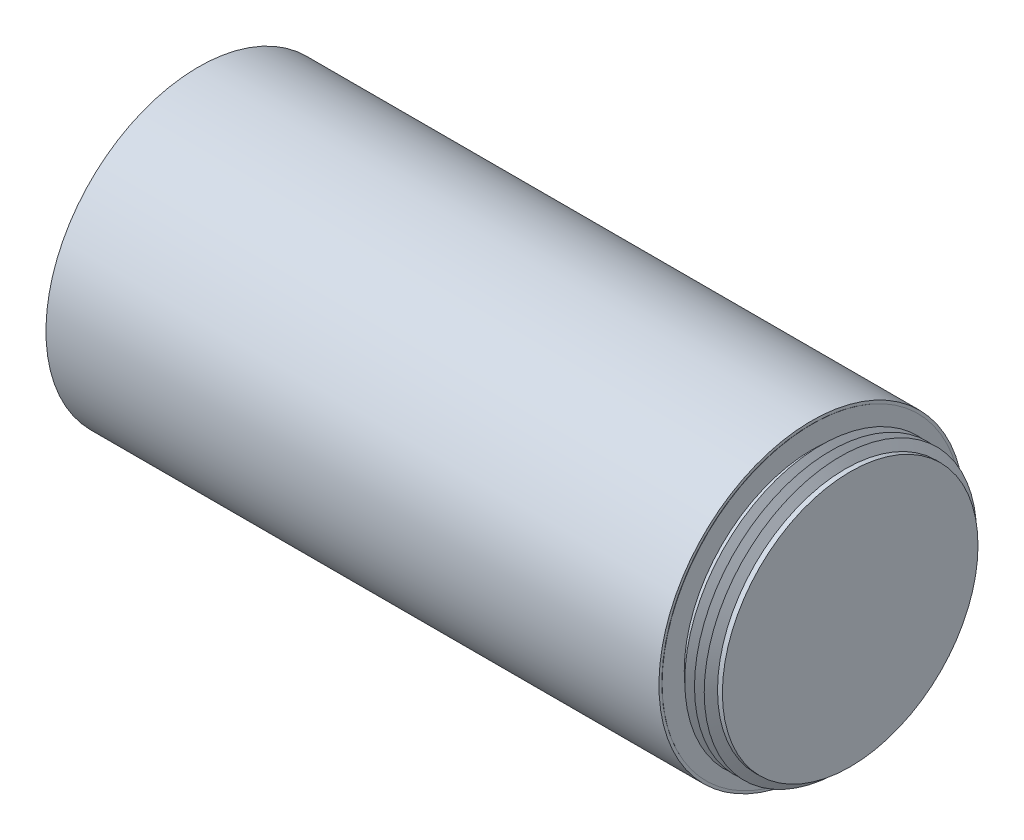
ISO-10303-21;
HEADER;
FILE_DESCRIPTION(('STEP AP214'),'2;1');
FILE_NAME('part.step','',(''),(''),'','','');
FILE_SCHEMA(('AUTOMOTIVE_DESIGN { 1 0 10303 214 1 1 1 1 }'));
ENDSEC;
DATA;
#1=APPLICATION_CONTEXT('core data for automotive mechanical design processes');
#2=APPLICATION_PROTOCOL_DEFINITION('international standard','automotive_design',2000,#1);
#3=PRODUCT_CONTEXT('',#1,'mechanical');
#4=PRODUCT('Part','Part','',(#3));
#5=PRODUCT_RELATED_PRODUCT_CATEGORY('part','',(#4));
#6=PRODUCT_DEFINITION_FORMATION('','',#4);
#7=PRODUCT_DEFINITION_CONTEXT('part definition',#1,'design');
#8=PRODUCT_DEFINITION('design','',#6,#7);
#9=PRODUCT_DEFINITION_SHAPE('','',#8);
#10=(LENGTH_UNIT() NAMED_UNIT(*) SI_UNIT(.MILLI.,.METRE.));
#11=(NAMED_UNIT(*) PLANE_ANGLE_UNIT() SI_UNIT($,.RADIAN.));
#12=(NAMED_UNIT(*) SI_UNIT($,.STERADIAN.) SOLID_ANGLE_UNIT());
#13=UNCERTAINTY_MEASURE_WITH_UNIT(LENGTH_MEASURE(1.E-05),#10,'distance_accuracy_value','');
#14=(GEOMETRIC_REPRESENTATION_CONTEXT(3) GLOBAL_UNCERTAINTY_ASSIGNED_CONTEXT((#13)) GLOBAL_UNIT_ASSIGNED_CONTEXT((#10,
#11,#12)) REPRESENTATION_CONTEXT('',''));
#15=CARTESIAN_POINT('',(0.,0.,0.));
#16=DIRECTION('',(0.,0.,1.));
#17=DIRECTION('',(1.,0.,0.));
#18=AXIS2_PLACEMENT_3D('',#15,#16,#17);
#19=CARTESIAN_POINT('',(-101.282037882412,-112.40761589404,6.95959679333066E-13));
#20=DIRECTION('',(1.,0.,0.));
#21=DIRECTION('',(0.,0.203317589338989,0.979112842253324));
#22=AXIS2_PLACEMENT_3D('',#19,#20,#21);
#23=PLANE('',#22);
#24=CARTESIAN_POINT('',(-101.282037882412,-112.40761589404,6.95959679333066E-13));
#25=DIRECTION('',(1.,0.,0.));
#26=DIRECTION('',(0.,0.203317589338989,0.979112842253324));
#27=AXIS2_PLACEMENT_3D('',#24,#25,#26);
#28=CIRCLE('',#27,49.784);
#29=CARTESIAN_POINT('',(-101.282037882411,-102.285653026388,48.7441537387402));
#30=VERTEX_POINT('',#29);
#31=EDGE_CURVE('E67',#30,#30,#28,.T.);
#32=ORIENTED_EDGE('',*,*,#31,.T.);
#33=EDGE_LOOP('',(#32));
#34=FACE_BOUND('',#33,.T.);
#35=CARTESIAN_POINT('',(-101.282037882412,-112.40761589404,8.14057642514373E-13));
#36=DIRECTION('',(1.,0.,0.));
#37=DIRECTION('',(0.,0.,-1.));
#38=AXIS2_PLACEMENT_3D('',#35,#36,#37);
#39=CIRCLE('',#38,48.8237923991093);
#40=CARTESIAN_POINT('',(-101.282037882412,-112.40761589404,-48.8237923991085));
#41=VERTEX_POINT('',#40);
#42=EDGE_CURVE('E18',#41,#41,#39,.T.);
#43=ORIENTED_EDGE('',*,*,#42,.F.);
#44=EDGE_LOOP('',(#43));
#45=FACE_BOUND('',#44,.T.);
#46=ADVANCED_FACE('F14',(#34,#45),#23,.T.);
#47=CARTESIAN_POINT('',(-301.281637882411,-112.40761589404,9.0639775579916E-13));
#48=DIRECTION('',(1.,0.,0.));
#49=DIRECTION('',(0.,0.203317589338989,0.979112842253324));
#50=AXIS2_PLACEMENT_3D('',#47,#48,#49);
#51=PLANE('',#50);
#52=CARTESIAN_POINT('',(-301.281637882411,-112.40761589404,9.0639775579916E-13));
#53=DIRECTION('',(1.,0.,0.));
#54=DIRECTION('',(0.,0.203317589338989,0.979112842253324));
#55=AXIS2_PLACEMENT_3D('',#52,#53,#54);
#56=CIRCLE('',#55,49.784);
#57=CARTESIAN_POINT('',(-301.281637882411,-102.285653026388,48.7441537387404));
#58=VERTEX_POINT('',#57);
#59=EDGE_CURVE('E68',#58,#58,#56,.T.);
#60=ORIENTED_EDGE('',*,*,#59,.F.);
#61=EDGE_LOOP('',(#60));
#62=FACE_BOUND('',#61,.T.);
#63=CARTESIAN_POINT('',(-301.281637882411,-112.40761589404,8.95453312079027E-13));
#64=DIRECTION('',(1.,0.,0.));
#65=DIRECTION('',(0.,0.,-1.));
#66=AXIS2_PLACEMENT_3D('',#63,#64,#65);
#67=CIRCLE('',#66,48.9203999999995);
#68=CARTESIAN_POINT('',(-301.281637882412,-112.40761589404,-48.9203999999986));
#69=VERTEX_POINT('',#68);
#70=EDGE_CURVE('E64',#69,#69,#67,.F.);
#71=ORIENTED_EDGE('',*,*,#70,.F.);
#72=EDGE_LOOP('',(#71));
#73=FACE_BOUND('',#72,.T.);
#74=ADVANCED_FACE('F276',(#62,#73),#51,.F.);
#75=CARTESIAN_POINT('',(-101.282037882412,-112.40761589404,6.95959679333066E-13));
#76=DIRECTION('',(-1.,0.,0.));
#77=DIRECTION('',(0.,-0.203317589338989,-0.979112842253324));
#78=AXIS2_PLACEMENT_3D('',#75,#76,#77);
#79=CYLINDRICAL_SURFACE('',#78,49.784);
#80=ORIENTED_EDGE('',*,*,#31,.F.);
#81=EDGE_LOOP('',(#80));
#82=FACE_BOUND('',#81,.T.);
#83=ORIENTED_EDGE('',*,*,#59,.T.);
#84=EDGE_LOOP('',(#83));
#85=FACE_BOUND('',#84,.T.);
#86=ADVANCED_FACE('F283',(#82,#85),#79,.T.);
#87=CARTESIAN_POINT('',(-301.281637882412,-112.40761589404,8.88550369128855E-13));
#88=DIRECTION('',(1.,0.,0.));
#89=DIRECTION('',(0.,0.999990910254518,-0.00426373173999859));
#90=AXIS2_PLACEMENT_3D('',#87,#88,#89);
#91=CIRCLE('',#90,44.45);
#92=CARTESIAN_POINT('',(-301.281637882412,-67.9580199332265,-0.189522875842049));
#93=VERTEX_POINT('',#92);
#94=EDGE_CURVE('E155',#93,#93,#91,.T.);
#95=ORIENTED_EDGE('',*,*,#94,.T.);
#96=EDGE_LOOP('',(#95));
#97=FACE_BOUND('',#96,.T.);
#98=ORIENTED_EDGE('',*,*,#70,.T.);
#99=EDGE_LOOP('',(#98));
#100=FACE_BOUND('',#99,.T.);
#101=ADVANCED_FACE('F163',(#97,#100),#51,.F.);
#102=CARTESIAN_POINT('',(-101.114708609272,-112.40761589404,7.84938641112028E-13));
#103=DIRECTION('',(1.,0.,0.));
#104=DIRECTION('',(0.,0.,-1.));
#105=AXIS2_PLACEMENT_3D('',#102,#103,#104);
#106=CONICAL_SURFACE('',#105,48.9204,0.523598775598301);
#107=ORIENTED_EDGE('',*,*,#42,.T.);
#108=EDGE_LOOP('',(#107));
#109=FACE_BOUND('',#108,.T.);
#110=CARTESIAN_POINT('',(-101.114708609272,-112.40761589404,7.84938641112028E-13));
#111=DIRECTION('',(-1.,0.,0.));
#112=DIRECTION('',(0.,0.,1.));
#113=AXIS2_PLACEMENT_3D('',#110,#111,#112);
#114=CIRCLE('',#113,48.9204);
#115=CARTESIAN_POINT('',(-101.114708609272,-112.40761589404,48.9204000000008));
#116=VERTEX_POINT('',#115);
#117=EDGE_CURVE('E9',#116,#116,#114,.T.);
#118=ORIENTED_EDGE('',*,*,#117,.T.);
#119=EDGE_LOOP('',(#118));
#120=FACE_BOUND('',#119,.T.);
#121=ADVANCED_FACE('F16',(#109,#120),#106,.T.);
#122=CARTESIAN_POINT('',(-101.114708609272,-63.4872158940397,7.84938641112028E-13));
#123=DIRECTION('',(-1.,0.,0.));
#124=DIRECTION('',(0.,0.,1.));
#125=AXIS2_PLACEMENT_3D('',#122,#123,#124);
#126=PLANE('',#125);
#127=ORIENTED_EDGE('',*,*,#117,.F.);
#128=EDGE_LOOP('',(#127));
#129=FACE_BOUND('',#128,.T.);
#130=CARTESIAN_POINT('',(-101.114708609271,-112.40761589404,7.84938641112028E-13));
#131=DIRECTION('',(1.,0.,0.));
#132=DIRECTION('',(0.,0.,-1.));
#133=AXIS2_PLACEMENT_3D('',#130,#131,#132);
#134=CIRCLE('',#133,41.70035475);
#135=CARTESIAN_POINT('',(-101.114708609271,-112.40761589404,-41.7003547499992));
#136=VERTEX_POINT('',#135);
#137=EDGE_CURVE('E23',#136,#136,#134,.T.);
#138=ORIENTED_EDGE('',*,*,#137,.F.);
#139=EDGE_LOOP('',(#138));
#140=FACE_BOUND('',#139,.T.);
#141=ADVANCED_FACE('F329',(#129,#140),#126,.F.);
#142=CARTESIAN_POINT('',(-88.6687086092715,-67.9576158940398,7.84938641112028E-13));
#143=DIRECTION('',(-1.,0.,0.));
#144=DIRECTION('',(0.,0.,1.));
#145=AXIS2_PLACEMENT_3D('',#142,#143,#144);
#146=PLANE('',#145);
#147=CARTESIAN_POINT('',(-88.6687086092715,-112.40761589404,7.84938641112028E-13));
#148=DIRECTION('',(1.,0.,0.));
#149=DIRECTION('',(0.,0.,-1.));
#150=AXIS2_PLACEMENT_3D('',#147,#148,#149);
#151=CIRCLE('',#150,41.70035475);
#152=CARTESIAN_POINT('',(-88.6687086092715,-112.40761589404,-41.7003547499992));
#153=VERTEX_POINT('',#152);
#154=EDGE_CURVE('E60',#153,#153,#151,.T.);
#155=ORIENTED_EDGE('',*,*,#154,.T.);
#156=EDGE_LOOP('',(#155));
#157=FACE_BOUND('',#156,.T.);
#158=ADVANCED_FACE('F326',(#157),#146,.F.);
#159=CARTESIAN_POINT('',(-88.6687086092715,-112.40761589404,7.84938641112028E-13));
#160=DIRECTION('',(1.,0.,0.));
#161=DIRECTION('',(0.,0.,-1.));
#162=AXIS2_PLACEMENT_3D('',#159,#160,#161);
#163=CYLINDRICAL_SURFACE('',#162,41.70035475);
#164=CARTESIAN_POINT('',(-99.7812591608523,-112.40761589404,7.84938641112028E-13));
#165=DIRECTION('',(1.,0.,0.));
#166=DIRECTION('',(0.,0.,-1.));
#167=AXIS2_PLACEMENT_3D('',#164,#165,#166);
#168=CIRCLE('',#167,41.70035475);
#169=CARTESIAN_POINT('',(-99.7812591608523,-112.40761589404,-41.7003547499992));
#170=VERTEX_POINT('',#169);
#171=EDGE_CURVE('E30',#170,#170,#168,.T.);
#172=ORIENTED_EDGE('',*,*,#171,.F.);
#173=EDGE_LOOP('',(#172));
#174=FACE_BOUND('',#173,.T.);
#175=ORIENTED_EDGE('',*,*,#137,.T.);
#176=EDGE_LOOP('',(#175));
#177=FACE_BOUND('',#176,.T.);
#178=ADVANCED_FACE('F322',(#174,#177),#163,.T.);
#179=CARTESIAN_POINT('',(-99.7812591608523,-112.40761589404,7.84938641112028E-13));
#180=DIRECTION('',(1.,0.,0.));
#181=DIRECTION('',(0.,0.,-1.));
#182=AXIS2_PLACEMENT_3D('',#179,#180,#181);
#183=CONICAL_SURFACE('',#182,41.70035475,1.0471975511966);
#184=CARTESIAN_POINT('',(-98.1937507355888,-112.40761589404,7.84938641112028E-13));
#185=DIRECTION('',(1.,0.,0.));
#186=DIRECTION('',(0.,0.,-1.));
#187=AXIS2_PLACEMENT_3D('',#184,#185,#186);
#188=CIRCLE('',#187,44.45);
#189=CARTESIAN_POINT('',(-98.1937507355888,-112.40761589404,-44.4499999999992));
#190=VERTEX_POINT('',#189);
#191=EDGE_CURVE('E36',#190,#190,#188,.T.);
#192=ORIENTED_EDGE('',*,*,#191,.F.);
#193=EDGE_LOOP('',(#192));
#194=FACE_BOUND('',#193,.T.);
#195=ORIENTED_EDGE('',*,*,#171,.T.);
#196=EDGE_LOOP('',(#195));
#197=FACE_BOUND('',#196,.T.);
#198=ADVANCED_FACE('F318',(#194,#197),#183,.T.);
#199=CARTESIAN_POINT('',(-98.1937507355888,-112.40761589404,7.84938641112028E-13));
#200=DIRECTION('',(-1.,0.,0.));
#201=DIRECTION('',(0.,0.,1.));
#202=AXIS2_PLACEMENT_3D('',#199,#200,#201);
#203=CONICAL_SURFACE('',#202,44.45,1.0471975511966);
#204=CARTESIAN_POINT('',(-96.6062423103254,-112.40761589404,7.84938641112028E-13));
#205=DIRECTION('',(1.,0.,0.));
#206=DIRECTION('',(0.,0.,-1.));
#207=AXIS2_PLACEMENT_3D('',#204,#205,#206);
#208=CIRCLE('',#207,41.70035475);
#209=CARTESIAN_POINT('',(-96.6062423103254,-112.40761589404,-41.7003547499992));
#210=VERTEX_POINT('',#209);
#211=EDGE_CURVE('E40',#210,#210,#208,.T.);
#212=ORIENTED_EDGE('',*,*,#211,.F.);
#213=EDGE_LOOP('',(#212));
#214=FACE_BOUND('',#213,.T.);
#215=ORIENTED_EDGE('',*,*,#191,.T.);
#216=EDGE_LOOP('',(#215));
#217=FACE_BOUND('',#216,.T.);
#218=ADVANCED_FACE('F314',(#214,#217),#203,.T.);
#219=CARTESIAN_POINT('',(-96.6062423103254,-112.40761589404,7.84938641112028E-13));
#220=DIRECTION('',(1.,0.,0.));
#221=DIRECTION('',(0.,0.,-1.));
#222=AXIS2_PLACEMENT_3D('',#219,#220,#221);
#223=CONICAL_SURFACE('',#222,41.70035475,1.0471975511966);
#224=CARTESIAN_POINT('',(-95.0187338850619,-112.40761589404,7.84938641112028E-13));
#225=DIRECTION('',(1.,0.,0.));
#226=DIRECTION('',(0.,0.,-1.));
#227=AXIS2_PLACEMENT_3D('',#224,#225,#226);
#228=CIRCLE('',#227,44.45);
#229=CARTESIAN_POINT('',(-95.0187338850619,-112.40761589404,-44.4499999999992));
#230=VERTEX_POINT('',#229);
#231=EDGE_CURVE('E44',#230,#230,#228,.T.);
#232=ORIENTED_EDGE('',*,*,#231,.F.);
#233=EDGE_LOOP('',(#232));
#234=FACE_BOUND('',#233,.T.);
#235=ORIENTED_EDGE('',*,*,#211,.T.);
#236=EDGE_LOOP('',(#235));
#237=FACE_BOUND('',#236,.T.);
#238=ADVANCED_FACE('F310',(#234,#237),#223,.T.);
#239=CARTESIAN_POINT('',(-95.0187338850619,-112.40761589404,7.84938641112028E-13));
#240=DIRECTION('',(-1.,0.,0.));
#241=DIRECTION('',(0.,0.,1.));
#242=AXIS2_PLACEMENT_3D('',#239,#240,#241);
#243=CONICAL_SURFACE('',#242,44.45,1.0471975511966);
#244=CARTESIAN_POINT('',(-93.4312254597984,-112.40761589404,7.84938641112028E-13));
#245=DIRECTION('',(1.,0.,0.));
#246=DIRECTION('',(0.,0.,-1.));
#247=AXIS2_PLACEMENT_3D('',#244,#245,#246);
#248=CIRCLE('',#247,41.70035475);
#249=CARTESIAN_POINT('',(-93.4312254597984,-112.40761589404,-41.7003547499992));
#250=VERTEX_POINT('',#249);
#251=EDGE_CURVE('E48',#250,#250,#248,.T.);
#252=ORIENTED_EDGE('',*,*,#251,.F.);
#253=EDGE_LOOP('',(#252));
#254=FACE_BOUND('',#253,.T.);
#255=ORIENTED_EDGE('',*,*,#231,.T.);
#256=EDGE_LOOP('',(#255));
#257=FACE_BOUND('',#256,.T.);
#258=ADVANCED_FACE('F306',(#254,#257),#243,.T.);
#259=CARTESIAN_POINT('',(-93.4312254597984,-112.40761589404,7.84938641112028E-13));
#260=DIRECTION('',(1.,0.,0.));
#261=DIRECTION('',(0.,0.,-1.));
#262=AXIS2_PLACEMENT_3D('',#259,#260,#261);
#263=CONICAL_SURFACE('',#262,41.70035475,1.0471975511966);
#264=CARTESIAN_POINT('',(-91.843717034535,-112.40761589404,7.84938641112028E-13));
#265=DIRECTION('',(1.,0.,0.));
#266=DIRECTION('',(0.,0.,-1.));
#267=AXIS2_PLACEMENT_3D('',#264,#265,#266);
#268=CIRCLE('',#267,44.45);
#269=CARTESIAN_POINT('',(-91.843717034535,-112.40761589404,-44.4499999999992));
#270=VERTEX_POINT('',#269);
#271=EDGE_CURVE('E52',#270,#270,#268,.T.);
#272=ORIENTED_EDGE('',*,*,#271,.F.);
#273=EDGE_LOOP('',(#272));
#274=FACE_BOUND('',#273,.T.);
#275=ORIENTED_EDGE('',*,*,#251,.T.);
#276=EDGE_LOOP('',(#275));
#277=FACE_BOUND('',#276,.T.);
#278=ADVANCED_FACE('F302',(#274,#277),#263,.T.);
#279=CARTESIAN_POINT('',(-91.843717034535,-112.40761589404,7.84938641112028E-13));
#280=DIRECTION('',(-1.,0.,0.));
#281=DIRECTION('',(0.,0.,1.));
#282=AXIS2_PLACEMENT_3D('',#279,#280,#281);
#283=CONICAL_SURFACE('',#282,44.45,1.04719755119659);
#284=CARTESIAN_POINT('',(-90.2562086092715,-112.40761589404,7.84938641112028E-13));
#285=DIRECTION('',(1.,0.,0.));
#286=DIRECTION('',(0.,0.,-1.));
#287=AXIS2_PLACEMENT_3D('',#284,#285,#286);
#288=CIRCLE('',#287,41.70035475);
#289=CARTESIAN_POINT('',(-90.2562086092715,-112.40761589404,-41.7003547499992));
#290=VERTEX_POINT('',#289);
#291=EDGE_CURVE('E56',#290,#290,#288,.T.);
#292=ORIENTED_EDGE('',*,*,#291,.F.);
#293=EDGE_LOOP('',(#292));
#294=FACE_BOUND('',#293,.T.);
#295=ORIENTED_EDGE('',*,*,#271,.T.);
#296=EDGE_LOOP('',(#295));
#297=FACE_BOUND('',#296,.T.);
#298=ADVANCED_FACE('F298',(#294,#297),#283,.T.);
#299=CARTESIAN_POINT('',(-88.6687086092715,-112.40761589404,7.84938641112028E-13));
#300=DIRECTION('',(1.,0.,0.));
#301=DIRECTION('',(0.,0.,-1.));
#302=AXIS2_PLACEMENT_3D('',#299,#300,#301);
#303=CYLINDRICAL_SURFACE('',#302,41.70035475);
#304=ORIENTED_EDGE('',*,*,#154,.F.);
#305=EDGE_LOOP('',(#304));
#306=FACE_BOUND('',#305,.T.);
#307=ORIENTED_EDGE('',*,*,#291,.T.);
#308=EDGE_LOOP('',(#307));
#309=FACE_BOUND('',#308,.T.);
#310=ADVANCED_FACE('F295',(#306,#309),#303,.T.);
#311=CARTESIAN_POINT('',(-256.577637882412,-112.40761589404,6.90740480149237E-13));
#312=DIRECTION('',(-1.,0.,0.));
#313=DIRECTION('',(0.,0.,1.));
#314=AXIS2_PLACEMENT_3D('',#311,#312,#313);
#315=PLANE('',#314);
#316=CARTESIAN_POINT('',(-256.577637882412,-112.40761589404,6.90740480149237E-13));
#317=DIRECTION('',(-1.,0.,0.));
#318=DIRECTION('',(0.,-0.999990910254518,0.00426373173999859));
#319=AXIS2_PLACEMENT_3D('',#316,#317,#318);
#320=CIRCLE('',#319,36.449);
#321=CARTESIAN_POINT('',(-256.577637882412,-148.856284581907,0.1554087581919));
#322=VERTEX_POINT('',#321);
#323=EDGE_CURVE('E151',#322,#322,#320,.T.);
#324=ORIENTED_EDGE('',*,*,#323,.T.);
#325=EDGE_LOOP('',(#324));
#326=FACE_BOUND('',#325,.T.);
#327=ADVANCED_FACE('F288',(#326),#315,.T.);
#328=CARTESIAN_POINT('',(-258.101637882412,-112.40761589404,7.61486444201488E-13));
#329=DIRECTION('',(1.,0.,0.));
#330=DIRECTION('',(0.,0.999990910254518,-0.00426373173999859));
#331=AXIS2_PLACEMENT_3D('',#328,#329,#330);
#332=CONICAL_SURFACE('',#331,34.925,0.785398163397451);
#333=ORIENTED_EDGE('',*,*,#323,.F.);
#334=EDGE_LOOP('',(#333));
#335=FACE_BOUND('',#334,.T.);
#336=CARTESIAN_POINT('',(-258.101637882412,-112.40761589404,7.61486444201488E-13));
#337=DIRECTION('',(-1.,0.,0.));
#338=DIRECTION('',(0.,-0.999990910254518,0.00426373173999859));
#339=AXIS2_PLACEMENT_3D('',#336,#337,#338);
#340=CIRCLE('',#339,34.925);
#341=CARTESIAN_POINT('',(-258.101637882412,-147.332298434679,0.148910831020212));
#342=VERTEX_POINT('',#341);
#343=EDGE_CURVE('E143',#342,#342,#340,.F.);
#344=ORIENTED_EDGE('',*,*,#343,.F.);
#345=EDGE_LOOP('',(#344));
#346=FACE_BOUND('',#345,.T.);
#347=ADVANCED_FACE('F170',(#335,#346),#332,.F.);
#348=CARTESIAN_POINT('',(-301.281637882412,-112.40761589404,8.88550369128855E-13));
#349=DIRECTION('',(1.,0.,0.));
#350=DIRECTION('',(0.,0.999990910254518,-0.00426373173999859));
#351=AXIS2_PLACEMENT_3D('',#348,#349,#350);
#352=CYLINDRICAL_SURFACE('',#351,44.45);
#353=ORIENTED_EDGE('',*,*,#94,.F.);
#354=EDGE_LOOP('',(#353));
#355=FACE_BOUND('',#354,.T.);
#356=CARTESIAN_POINT('',(-299.503637882412,-112.40761589404,8.86841785885611E-13));
#357=DIRECTION('',(1.,0.,0.));
#358=DIRECTION('',(0.,0.999990910254518,-0.00426373173999859));
#359=AXIS2_PLACEMENT_3D('',#356,#357,#358);
#360=CIRCLE('',#359,44.45);
#361=CARTESIAN_POINT('',(-299.503637882412,-67.9580199332265,-0.189522875842051));
#362=VERTEX_POINT('',#361);
#363=EDGE_CURVE('E72',#362,#362,#360,.T.);
#364=ORIENTED_EDGE('',*,*,#363,.T.);
#365=EDGE_LOOP('',(#364));
#366=FACE_BOUND('',#365,.T.);
#367=ADVANCED_FACE('F166',(#355,#366),#352,.F.);
#368=CARTESIAN_POINT('',(-297.916129457149,-112.40761589404,8.85726702298336E-13));
#369=DIRECTION('',(-1.,0.,0.));
#370=DIRECTION('',(0.,-0.999990910254518,0.00426373173999859));
#371=AXIS2_PLACEMENT_3D('',#368,#369,#370);
#372=CONICAL_SURFACE('',#371,41.70035475,1.0471975511966);
#373=ORIENTED_EDGE('',*,*,#363,.F.);
#374=EDGE_LOOP('',(#373));
#375=FACE_BOUND('',#374,.T.);
#376=CARTESIAN_POINT('',(-297.916129457149,-112.40761589404,8.85726702298336E-13));
#377=DIRECTION('',(1.,0.,0.));
#378=DIRECTION('',(0.,0.999990910254518,-0.00426373173999859));
#379=AXIS2_PLACEMENT_3D('',#376,#377,#378);
#380=CIRCLE('',#379,41.70035475);
#381=CARTESIAN_POINT('',(-297.916129457149,-70.707640189651,-0.17779912611589));
#382=VERTEX_POINT('',#381);
#383=EDGE_CURVE('E79',#382,#382,#380,.T.);
#384=ORIENTED_EDGE('',*,*,#383,.T.);
#385=EDGE_LOOP('',(#384));
#386=FACE_BOUND('',#385,.T.);
#387=ADVANCED_FACE('F169',(#375,#386),#372,.F.);
#388=CARTESIAN_POINT('',(-296.328621031885,-112.40761589404,8.84177941784115E-13));
#389=DIRECTION('',(1.,0.,0.));
#390=DIRECTION('',(0.,0.999990910254518,-0.00426373173999859));
#391=AXIS2_PLACEMENT_3D('',#388,#389,#390);
#392=CONICAL_SURFACE('',#391,44.45,1.04719755119659);
#393=ORIENTED_EDGE('',*,*,#383,.F.);
#394=EDGE_LOOP('',(#393));
#395=FACE_BOUND('',#394,.T.);
#396=CARTESIAN_POINT('',(-296.328621031885,-112.40761589404,8.84177941784115E-13));
#397=DIRECTION('',(1.,0.,0.));
#398=DIRECTION('',(0.,0.999990910254518,-0.00426373173999859));
#399=AXIS2_PLACEMENT_3D('',#396,#397,#398);
#400=CIRCLE('',#399,44.45);
#401=CARTESIAN_POINT('',(-296.328621031885,-67.9580199332265,-0.189522875842053));
#402=VERTEX_POINT('',#401);
#403=EDGE_CURVE('E83',#402,#402,#400,.T.);
#404=ORIENTED_EDGE('',*,*,#403,.T.);
#405=EDGE_LOOP('',(#404));
#406=FACE_BOUND('',#405,.T.);
#407=ADVANCED_FACE('F176',(#395,#406),#392,.F.);
#408=CARTESIAN_POINT('',(-294.741116819237,-112.40761589404,8.82846023267758E-13));
#409=DIRECTION('',(-1.,0.,0.));
#410=DIRECTION('',(0.,-0.999990910254518,0.00426373173999859));
#411=AXIS2_PLACEMENT_3D('',#408,#409,#410);
#412=CONICAL_SURFACE('',#411,41.7003620464632,1.0471975511966);
#413=ORIENTED_EDGE('',*,*,#403,.F.);
#414=EDGE_LOOP('',(#413));
#415=FACE_BOUND('',#414,.T.);
#416=CARTESIAN_POINT('',(-294.741116819237,-112.40761589404,8.82846023267758E-13));
#417=DIRECTION('',(1.,0.,0.));
#418=DIRECTION('',(0.,0.999990910254518,-0.00426373173999859));
#419=AXIS2_PLACEMENT_3D('',#416,#417,#418);
#420=CIRCLE('',#419,41.7003620464632);
#421=CARTESIAN_POINT('',(-294.741116819237,-70.7076328932541,-0.177799157226055));
#422=VERTEX_POINT('',#421);
#423=EDGE_CURVE('E87',#422,#422,#420,.T.);
#424=ORIENTED_EDGE('',*,*,#423,.T.);
#425=EDGE_LOOP('',(#424));
#426=FACE_BOUND('',#425,.T.);
#427=ADVANCED_FACE('F182',(#415,#426),#412,.F.);
#428=CARTESIAN_POINT('',(-293.153608393973,-112.40761589404,8.81514101217009E-13));
#429=DIRECTION('',(1.,0.,0.));
#430=DIRECTION('',(0.,0.999990910254518,-0.00426373173999859));
#431=AXIS2_PLACEMENT_3D('',#428,#429,#430);
#432=CONICAL_SURFACE('',#431,44.4500072964631,1.04719755119659);
#433=ORIENTED_EDGE('',*,*,#423,.F.);
#434=EDGE_LOOP('',(#433));
#435=FACE_BOUND('',#434,.T.);
#436=CARTESIAN_POINT('',(-293.153608393973,-112.40761589404,8.81514101217009E-13));
#437=DIRECTION('',(1.,0.,0.));
#438=DIRECTION('',(0.,0.999990910254518,-0.00426373173999859));
#439=AXIS2_PLACEMENT_3D('',#436,#437,#438);
#440=CIRCLE('',#439,44.4500072964631);
#441=CARTESIAN_POINT('',(-293.153608393973,-67.9580126368296,-0.189522906952217));
#442=VERTEX_POINT('',#441);
#443=EDGE_CURVE('E91',#442,#442,#440,.T.);
#444=ORIENTED_EDGE('',*,*,#443,.T.);
#445=EDGE_LOOP('',(#444));
#446=FACE_BOUND('',#445,.T.);
#447=ADVANCED_FACE('F188',(#435,#446),#432,.F.);
#448=CARTESIAN_POINT('',(-291.566104181325,-112.40761589404,8.80182182700652E-13));
#449=DIRECTION('',(-1.,0.,0.));
#450=DIRECTION('',(0.,-0.999990910254518,0.00426373173999859));
#451=AXIS2_PLACEMENT_3D('',#448,#449,#450);
#452=CONICAL_SURFACE('',#451,41.7003693429263,1.0471975511966);
#453=ORIENTED_EDGE('',*,*,#443,.F.);
#454=EDGE_LOOP('',(#453));
#455=FACE_BOUND('',#454,.T.);
#456=CARTESIAN_POINT('',(-291.566104181325,-112.40761589404,8.80182182700652E-13));
#457=DIRECTION('',(1.,0.,0.));
#458=DIRECTION('',(0.,0.999990910254518,-0.00426373173999859));
#459=AXIS2_PLACEMENT_3D('',#456,#457,#458);
#460=CIRCLE('',#459,41.7003693429263);
#461=CARTESIAN_POINT('',(-291.566104181325,-70.7076255968573,-0.177799188336219));
#462=VERTEX_POINT('',#461);
#463=EDGE_CURVE('E95',#462,#462,#460,.T.);
#464=ORIENTED_EDGE('',*,*,#463,.T.);
#465=EDGE_LOOP('',(#464));
#466=FACE_BOUND('',#465,.T.);
#467=ADVANCED_FACE('F194',(#455,#466),#452,.F.);
#468=CARTESIAN_POINT('',(-289.978595756061,-112.40761589404,8.78850260649904E-13));
#469=DIRECTION('',(1.,0.,0.));
#470=DIRECTION('',(0.,0.999990910254518,-0.00426373173999859));
#471=AXIS2_PLACEMENT_3D('',#468,#469,#470);
#472=CONICAL_SURFACE('',#471,44.4500145929263,1.04719755119659);
#473=ORIENTED_EDGE('',*,*,#463,.F.);
#474=EDGE_LOOP('',(#473));
#475=FACE_BOUND('',#474,.T.);
#476=CARTESIAN_POINT('',(-289.978595756061,-112.40761589404,8.78850260649904E-13));
#477=DIRECTION('',(1.,0.,0.));
#478=DIRECTION('',(0.,0.999990910254518,-0.00426373173999859));
#479=AXIS2_PLACEMENT_3D('',#476,#477,#478);
#480=CIRCLE('',#479,44.4500145929263);
#481=CARTESIAN_POINT('',(-289.978595756061,-67.9580053404328,-0.189522938062382));
#482=VERTEX_POINT('',#481);
#483=EDGE_CURVE('E99',#482,#482,#480,.T.);
#484=ORIENTED_EDGE('',*,*,#483,.T.);
#485=EDGE_LOOP('',(#484));
#486=FACE_BOUND('',#485,.T.);
#487=ADVANCED_FACE('F200',(#475,#486),#472,.F.);
#488=CARTESIAN_POINT('',(-288.391091543413,-112.40761589404,8.77518342133547E-13));
#489=DIRECTION('',(-1.,0.,0.));
#490=DIRECTION('',(0.,-0.999990910254518,0.00426373173999859));
#491=AXIS2_PLACEMENT_3D('',#488,#489,#490);
#492=CONICAL_SURFACE('',#491,41.7003766393895,1.0471975511966);
#493=ORIENTED_EDGE('',*,*,#483,.F.);
#494=EDGE_LOOP('',(#493));
#495=FACE_BOUND('',#494,.T.);
#496=CARTESIAN_POINT('',(-288.391091543413,-112.40761589404,8.77518342133547E-13));
#497=DIRECTION('',(1.,0.,0.));
#498=DIRECTION('',(0.,0.999990910254518,-0.00426373173999859));
#499=AXIS2_PLACEMENT_3D('',#496,#497,#498);
#500=CIRCLE('',#499,41.7003766393895);
#501=CARTESIAN_POINT('',(-288.391091543413,-70.7076183004604,-0.177799219446383));
#502=VERTEX_POINT('',#501);
#503=EDGE_CURVE('E103',#502,#502,#500,.T.);
#504=ORIENTED_EDGE('',*,*,#503,.T.);
#505=EDGE_LOOP('',(#504));
#506=FACE_BOUND('',#505,.T.);
#507=ADVANCED_FACE('F206',(#495,#506),#492,.F.);
#508=CARTESIAN_POINT('',(-286.803583118149,-112.40761589404,8.76186420082799E-13));
#509=DIRECTION('',(1.,0.,0.));
#510=DIRECTION('',(0.,0.999990910254518,-0.00426373173999859));
#511=AXIS2_PLACEMENT_3D('',#508,#509,#510);
#512=CONICAL_SURFACE('',#511,44.4500218893895,1.04719755119659);
#513=ORIENTED_EDGE('',*,*,#503,.F.);
#514=EDGE_LOOP('',(#513));
#515=FACE_BOUND('',#514,.T.);
#516=CARTESIAN_POINT('',(-286.803583118149,-112.40761589404,8.76186420082799E-13));
#517=DIRECTION('',(1.,0.,0.));
#518=DIRECTION('',(0.,0.999990910254518,-0.00426373173999859));
#519=AXIS2_PLACEMENT_3D('',#516,#517,#518);
#520=CIRCLE('',#519,44.4500218893895);
#521=CARTESIAN_POINT('',(-286.803583118149,-67.9579980440359,-0.189522969172546));
#522=VERTEX_POINT('',#521);
#523=EDGE_CURVE('E107',#522,#522,#520,.T.);
#524=ORIENTED_EDGE('',*,*,#523,.T.);
#525=EDGE_LOOP('',(#524));
#526=FACE_BOUND('',#525,.T.);
#527=ADVANCED_FACE('F212',(#515,#526),#512,.F.);
#528=CARTESIAN_POINT('',(-285.216078905501,-112.40761589404,8.74854501566441E-13));
#529=DIRECTION('',(-1.,0.,0.));
#530=DIRECTION('',(0.,-0.999990910254518,0.00426373173999859));
#531=AXIS2_PLACEMENT_3D('',#528,#529,#530);
#532=CONICAL_SURFACE('',#531,41.7003839358526,1.0471975511966);
#533=ORIENTED_EDGE('',*,*,#523,.F.);
#534=EDGE_LOOP('',(#533));
#535=FACE_BOUND('',#534,.T.);
#536=CARTESIAN_POINT('',(-285.216078905501,-112.40761589404,8.74854501566441E-13));
#537=DIRECTION('',(1.,0.,0.));
#538=DIRECTION('',(0.,0.999990910254518,-0.00426373173999859));
#539=AXIS2_PLACEMENT_3D('',#536,#537,#538);
#540=CIRCLE('',#539,41.7003839358526);
#541=CARTESIAN_POINT('',(-285.216078905501,-70.7076110040636,-0.177799250556548));
#542=VERTEX_POINT('',#541);
#543=EDGE_CURVE('E111',#542,#542,#540,.T.);
#544=ORIENTED_EDGE('',*,*,#543,.T.);
#545=EDGE_LOOP('',(#544));
#546=FACE_BOUND('',#545,.T.);
#547=ADVANCED_FACE('F218',(#535,#546),#532,.F.);
#548=CARTESIAN_POINT('',(-283.628570480237,-112.40761589404,8.73522579515693E-13));
#549=DIRECTION('',(1.,0.,0.));
#550=DIRECTION('',(0.,0.999990910254518,-0.00426373173999859));
#551=AXIS2_PLACEMENT_3D('',#548,#549,#550);
#552=CONICAL_SURFACE('',#551,44.4500291858527,1.04719755119659);
#553=ORIENTED_EDGE('',*,*,#543,.F.);
#554=EDGE_LOOP('',(#553));
#555=FACE_BOUND('',#554,.T.);
#556=CARTESIAN_POINT('',(-283.628570480237,-112.40761589404,8.73522579515693E-13));
#557=DIRECTION('',(1.,0.,0.));
#558=DIRECTION('',(0.,0.999990910254518,-0.00426373173999859));
#559=AXIS2_PLACEMENT_3D('',#556,#557,#558);
#560=CIRCLE('',#559,44.4500291858527);
#561=CARTESIAN_POINT('',(-283.628570480237,-67.9579907476391,-0.18952300028271));
#562=VERTEX_POINT('',#561);
#563=EDGE_CURVE('E115',#562,#562,#560,.T.);
#564=ORIENTED_EDGE('',*,*,#563,.T.);
#565=EDGE_LOOP('',(#564));
#566=FACE_BOUND('',#565,.T.);
#567=ADVANCED_FACE('F224',(#555,#566),#552,.F.);
#568=CARTESIAN_POINT('',(-282.041066267589,-112.40761589404,8.72190660999336E-13));
#569=DIRECTION('',(-1.,0.,0.));
#570=DIRECTION('',(0.,-0.999990910254518,0.00426373173999859));
#571=AXIS2_PLACEMENT_3D('',#568,#569,#570);
#572=CONICAL_SURFACE('',#571,41.7003912323158,1.0471975511966);
#573=ORIENTED_EDGE('',*,*,#563,.F.);
#574=EDGE_LOOP('',(#573));
#575=FACE_BOUND('',#574,.T.);
#576=CARTESIAN_POINT('',(-282.041066267589,-112.40761589404,8.72190660999336E-13));
#577=DIRECTION('',(1.,0.,0.));
#578=DIRECTION('',(0.,0.999990910254518,-0.00426373173999859));
#579=AXIS2_PLACEMENT_3D('',#576,#577,#578);
#580=CIRCLE('',#579,41.7003912323158);
#581=CARTESIAN_POINT('',(-282.041066267589,-70.7076037076667,-0.177799281666712));
#582=VERTEX_POINT('',#581);
#583=EDGE_CURVE('E119',#582,#582,#580,.T.);
#584=ORIENTED_EDGE('',*,*,#583,.T.);
#585=EDGE_LOOP('',(#584));
#586=FACE_BOUND('',#585,.T.);
#587=ADVANCED_FACE('F230',(#575,#586),#572,.F.);
#588=CARTESIAN_POINT('',(-280.453557842325,-112.40761589404,8.70858738948588E-13));
#589=DIRECTION('',(1.,0.,0.));
#590=DIRECTION('',(0.,0.999990910254518,-0.00426373173999859));
#591=AXIS2_PLACEMENT_3D('',#588,#589,#590);
#592=CONICAL_SURFACE('',#591,44.4500364823158,1.04719755119659);
#593=ORIENTED_EDGE('',*,*,#583,.F.);
#594=EDGE_LOOP('',(#593));
#595=FACE_BOUND('',#594,.T.);
#596=CARTESIAN_POINT('',(-280.453557842325,-112.40761589404,8.70858738948588E-13));
#597=DIRECTION('',(1.,0.,0.));
#598=DIRECTION('',(0.,0.999990910254518,-0.00426373173999859));
#599=AXIS2_PLACEMENT_3D('',#596,#597,#598);
#600=CIRCLE('',#599,44.4500364823158);
#601=CARTESIAN_POINT('',(-280.453557842325,-67.9579834512422,-0.189523031392875));
#602=VERTEX_POINT('',#601);
#603=EDGE_CURVE('E123',#602,#602,#600,.T.);
#604=ORIENTED_EDGE('',*,*,#603,.T.);
#605=EDGE_LOOP('',(#604));
#606=FACE_BOUND('',#605,.T.);
#607=ADVANCED_FACE('F236',(#595,#606),#592,.F.);
#608=CARTESIAN_POINT('',(-278.866053629677,-112.40761589404,8.6952682043223E-13));
#609=DIRECTION('',(-1.,0.,0.));
#610=DIRECTION('',(0.,-0.999990910254518,0.00426373173999859));
#611=AXIS2_PLACEMENT_3D('',#608,#609,#610);
#612=CONICAL_SURFACE('',#611,41.700398528779,1.0471975511966);
#613=ORIENTED_EDGE('',*,*,#603,.F.);
#614=EDGE_LOOP('',(#613));
#615=FACE_BOUND('',#614,.T.);
#616=CARTESIAN_POINT('',(-278.866053629677,-112.40761589404,8.6952682043223E-13));
#617=DIRECTION('',(1.,0.,0.));
#618=DIRECTION('',(0.,0.999990910254518,-0.00426373173999859));
#619=AXIS2_PLACEMENT_3D('',#616,#617,#618);
#620=CIRCLE('',#619,41.700398528779);
#621=CARTESIAN_POINT('',(-278.866053629677,-70.7075964112699,-0.177799312776876));
#622=VERTEX_POINT('',#621);
#623=EDGE_CURVE('E127',#622,#622,#620,.T.);
#624=ORIENTED_EDGE('',*,*,#623,.T.);
#625=EDGE_LOOP('',(#624));
#626=FACE_BOUND('',#625,.T.);
#627=ADVANCED_FACE('F242',(#615,#626),#612,.F.);
#628=CARTESIAN_POINT('',(-277.278545204414,-112.40761589404,8.68194898381482E-13));
#629=DIRECTION('',(1.,0.,0.));
#630=DIRECTION('',(0.,0.999990910254518,-0.00426373173999859));
#631=AXIS2_PLACEMENT_3D('',#628,#629,#630);
#632=CONICAL_SURFACE('',#631,44.450043778779,1.04719755119659);
#633=ORIENTED_EDGE('',*,*,#623,.F.);
#634=EDGE_LOOP('',(#633));
#635=FACE_BOUND('',#634,.T.);
#636=CARTESIAN_POINT('',(-277.278545204414,-112.40761589404,8.68194898381482E-13));
#637=DIRECTION('',(1.,0.,0.));
#638=DIRECTION('',(0.,0.999990910254518,-0.00426373173999859));
#639=AXIS2_PLACEMENT_3D('',#636,#637,#638);
#640=CIRCLE('',#639,44.450043778779);
#641=CARTESIAN_POINT('',(-277.278545204414,-67.9579761548454,-0.189523062503039));
#642=VERTEX_POINT('',#641);
#643=EDGE_CURVE('E131',#642,#642,#640,.T.);
#644=ORIENTED_EDGE('',*,*,#643,.T.);
#645=EDGE_LOOP('',(#644));
#646=FACE_BOUND('',#645,.T.);
#647=ADVANCED_FACE('F248',(#635,#646),#632,.F.);
#648=CARTESIAN_POINT('',(-301.281637882412,-112.40761589404,8.88550369128855E-13));
#649=DIRECTION('',(1.,0.,0.));
#650=DIRECTION('',(0.,0.999990910254518,-0.00426373173999859));
#651=AXIS2_PLACEMENT_3D('',#648,#649,#650);
#652=CYLINDRICAL_SURFACE('',#651,44.450043778779);
#653=ORIENTED_EDGE('',*,*,#643,.F.);
#654=EDGE_LOOP('',(#653));
#655=FACE_BOUND('',#654,.T.);
#656=CARTESIAN_POINT('',(-275.627637882413,-112.40761589404,8.66809784557252E-13));
#657=DIRECTION('',(1.,0.,0.));
#658=DIRECTION('',(0.,0.999990910254518,-0.00426373173999859));
#659=AXIS2_PLACEMENT_3D('',#656,#657,#658);
#660=CIRCLE('',#659,44.450043778779);
#661=CARTESIAN_POINT('',(-275.627637882413,-67.9579761548454,-0.18952306250304));
#662=VERTEX_POINT('',#661);
#663=EDGE_CURVE('E135',#662,#662,#660,.T.);
#664=ORIENTED_EDGE('',*,*,#663,.T.);
#665=EDGE_LOOP('',(#664));
#666=FACE_BOUND('',#665,.T.);
#667=ADVANCED_FACE('F254',(#655,#666),#652,.F.);
#668=CARTESIAN_POINT('',(-275.627637882412,-112.40761589404,8.66809784557252E-13));
#669=DIRECTION('',(-1.,0.,0.));
#670=DIRECTION('',(0.,-0.999990910254518,0.00426373173999859));
#671=AXIS2_PLACEMENT_3D('',#668,#669,#670);
#672=PLANE('',#671);
#673=CARTESIAN_POINT('',(-275.627637882412,-112.40761589404,8.66809784557252E-13));
#674=DIRECTION('',(-1.,0.,0.));
#675=DIRECTION('',(0.,-0.999990910254518,0.00426373173999859));
#676=AXIS2_PLACEMENT_3D('',#673,#674,#675);
#677=CIRCLE('',#676,36.449);
#678=CARTESIAN_POINT('',(-275.627637882412,-148.856284581907,0.155408758192076));
#679=VERTEX_POINT('',#678);
#680=EDGE_CURVE('E139',#679,#679,#677,.F.);
#681=ORIENTED_EDGE('',*,*,#680,.T.);
#682=EDGE_LOOP('',(#681));
#683=FACE_BOUND('',#682,.T.);
#684=ORIENTED_EDGE('',*,*,#663,.F.);
#685=EDGE_LOOP('',(#684));
#686=FACE_BOUND('',#685,.T.);
#687=ADVANCED_FACE('F260',(#683,#686),#672,.T.);
#688=CARTESIAN_POINT('',(-275.627637882412,-112.40761589404,8.66809784557252E-13));
#689=DIRECTION('',(-1.,0.,0.));
#690=DIRECTION('',(0.,-0.999990910254518,0.00426373173999859));
#691=AXIS2_PLACEMENT_3D('',#688,#689,#690);
#692=CONICAL_SURFACE('',#691,36.449,0.785398163397447);
#693=CARTESIAN_POINT('',(-274.103637882412,-112.40761589404,8.65531146174591E-13));
#694=DIRECTION('',(-1.,0.,0.));
#695=DIRECTION('',(0.,-0.999990910254518,0.00426373173999859));
#696=AXIS2_PLACEMENT_3D('',#693,#694,#695);
#697=CIRCLE('',#696,34.925);
#698=CARTESIAN_POINT('',(-274.103637882412,-147.332298434679,0.148910831020316));
#699=VERTEX_POINT('',#698);
#700=EDGE_CURVE('E147',#699,#699,#697,.T.);
#701=ORIENTED_EDGE('',*,*,#700,.F.);
#702=EDGE_LOOP('',(#701));
#703=FACE_BOUND('',#702,.T.);
#704=ORIENTED_EDGE('',*,*,#680,.F.);
#705=EDGE_LOOP('',(#704));
#706=FACE_BOUND('',#705,.T.);
#707=ADVANCED_FACE('F265',(#703,#706),#692,.F.);
#708=CARTESIAN_POINT('',(-301.281637882412,-112.40761589404,8.88550369128855E-13));
#709=DIRECTION('',(1.,0.,0.));
#710=DIRECTION('',(0.,0.999990910254518,-0.00426373173999859));
#711=AXIS2_PLACEMENT_3D('',#708,#709,#710);
#712=CYLINDRICAL_SURFACE('',#711,34.925);
#713=ORIENTED_EDGE('',*,*,#700,.T.);
#714=EDGE_LOOP('',(#713));
#715=FACE_BOUND('',#714,.T.);
#716=ORIENTED_EDGE('',*,*,#343,.T.);
#717=EDGE_LOOP('',(#716));
#718=FACE_BOUND('',#717,.T.);
#719=ADVANCED_FACE('F272',(#715,#718),#712,.F.);
#720=CLOSED_SHELL('',(#46,#74,#86,#101,#121,#141,#158,#178,#198,#218,#238,#258,#278,#298,#310,
#327,#347,#367,#387,#407,#427,#447,#467,#487,#507,#527,#547,#567,#587,#607,#627,#647,#667,#687,
#707,#719));
#721=MANIFOLD_SOLID_BREP('B1',#720);
#722=ADVANCED_BREP_SHAPE_REPRESENTATION('',(#18,#721),#14);
#723=SHAPE_DEFINITION_REPRESENTATION(#9,#722);
ENDSEC;
END-ISO-10303-21;
